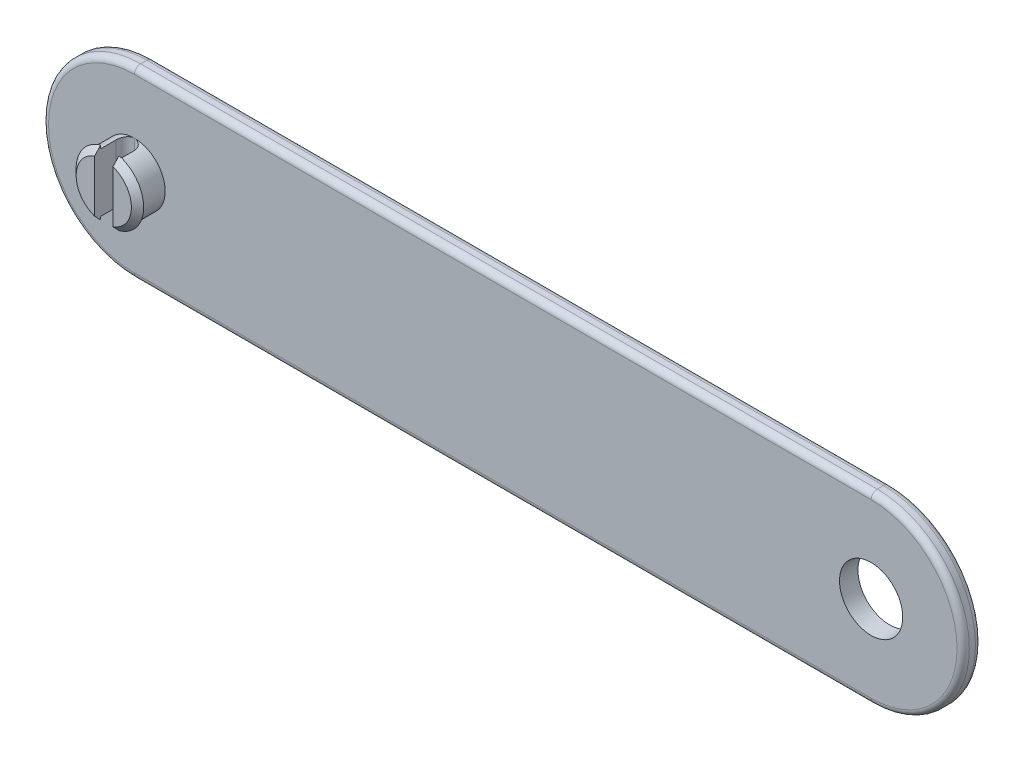
ISO-10303-21;
HEADER;
FILE_DESCRIPTION(('STEP AP214'),'2;1');
FILE_NAME('part.step','',(''),(''),'','','');
FILE_SCHEMA(('AUTOMOTIVE_DESIGN { 1 0 10303 214 1 1 1 1 }'));
ENDSEC;
DATA;
#1=APPLICATION_CONTEXT('core data for automotive mechanical design processes');
#2=APPLICATION_PROTOCOL_DEFINITION('international standard','automotive_design',2000,#1);
#3=PRODUCT_CONTEXT('',#1,'mechanical');
#4=PRODUCT('Part','Part','',(#3));
#5=PRODUCT_RELATED_PRODUCT_CATEGORY('part','',(#4));
#6=PRODUCT_DEFINITION_FORMATION('','',#4);
#7=PRODUCT_DEFINITION_CONTEXT('part definition',#1,'design');
#8=PRODUCT_DEFINITION('design','',#6,#7);
#9=PRODUCT_DEFINITION_SHAPE('','',#8);
#10=(LENGTH_UNIT() NAMED_UNIT(*) SI_UNIT(.MILLI.,.METRE.));
#11=(NAMED_UNIT(*) PLANE_ANGLE_UNIT() SI_UNIT($,.RADIAN.));
#12=(NAMED_UNIT(*) SI_UNIT($,.STERADIAN.) SOLID_ANGLE_UNIT());
#13=UNCERTAINTY_MEASURE_WITH_UNIT(LENGTH_MEASURE(1.E-05),#10,'distance_accuracy_value','');
#14=(GEOMETRIC_REPRESENTATION_CONTEXT(3) GLOBAL_UNCERTAINTY_ASSIGNED_CONTEXT((#13)) GLOBAL_UNIT_ASSIGNED_CONTEXT((#10,
#11,#12)) REPRESENTATION_CONTEXT('',''));
#15=CARTESIAN_POINT('',(0.,0.,0.));
#16=DIRECTION('',(0.,0.,1.));
#17=DIRECTION('',(1.,0.,0.));
#18=AXIS2_PLACEMENT_3D('',#15,#16,#17);
#19=CARTESIAN_POINT('',(0.,0.,3.));
#20=DIRECTION('',(0.,0.,1.));
#21=DIRECTION('',(1.,0.,0.));
#22=AXIS2_PLACEMENT_3D('',#19,#20,#21);
#23=PLANE('',#22);
#24=DIRECTION('',(1.,0.,0.));
#25=VECTOR('',#24,1.);
#26=CARTESIAN_POINT('',(0.,14.,3.));
#27=LINE('',#26,#25);
#28=CARTESIAN_POINT('',(120.,14.,3.));
#29=VERTEX_POINT('',#28);
#30=CARTESIAN_POINT('',(0.,14.,3.));
#31=VERTEX_POINT('',#30);
#32=EDGE_CURVE('E319',#29,#31,#27,.F.);
#33=ORIENTED_EDGE('',*,*,#32,.T.);
#34=CARTESIAN_POINT('',(0.,0.,3.));
#35=DIRECTION('',(0.,0.,1.));
#36=DIRECTION('',(1.,0.,0.));
#37=AXIS2_PLACEMENT_3D('',#34,#35,#36);
#38=CIRCLE('',#37,14.);
#39=CARTESIAN_POINT('',(0.,-14.,3.));
#40=VERTEX_POINT('',#39);
#41=EDGE_CURVE('E324',#31,#40,#38,.T.);
#42=ORIENTED_EDGE('',*,*,#41,.T.);
#43=DIRECTION('',(1.,0.,0.));
#44=VECTOR('',#43,1.);
#45=CARTESIAN_POINT('',(120.,-14.,3.));
#46=LINE('',#45,#44);
#47=CARTESIAN_POINT('',(120.,-14.,3.));
#48=VERTEX_POINT('',#47);
#49=EDGE_CURVE('E65',#40,#48,#46,.T.);
#50=ORIENTED_EDGE('',*,*,#49,.T.);
#51=CARTESIAN_POINT('',(120.,0.,3.));
#52=DIRECTION('',(0.,0.,1.));
#53=DIRECTION('',(1.,0.,0.));
#54=AXIS2_PLACEMENT_3D('',#51,#52,#53);
#55=CIRCLE('',#54,14.);
#56=EDGE_CURVE('E321',#48,#29,#55,.T.);
#57=ORIENTED_EDGE('',*,*,#56,.T.);
#58=EDGE_LOOP('',(#33,#42,#50,#57));
#59=FACE_BOUND('',#58,.T.);
#60=CARTESIAN_POINT('',(120.,0.,3.));
#61=DIRECTION('',(0.,0.,1.));
#62=DIRECTION('',(1.,0.,0.));
#63=AXIS2_PLACEMENT_3D('',#60,#61,#62);
#64=CIRCLE('',#63,5.14999999999998);
#65=CARTESIAN_POINT('',(125.15,0.,3.));
#66=VERTEX_POINT('',#65);
#67=EDGE_CURVE('E400',#66,#66,#64,.F.);
#68=ORIENTED_EDGE('',*,*,#67,.T.);
#69=EDGE_LOOP('',(#68));
#70=FACE_BOUND('',#69,.T.);
#71=CARTESIAN_POINT('',(0.,0.,3.));
#72=DIRECTION('',(0.,0.,1.));
#73=DIRECTION('',(1.,0.,0.));
#74=AXIS2_PLACEMENT_3D('',#71,#72,#73);
#75=CIRCLE('',#74,5.);
#76=CARTESIAN_POINT('',(0.,-5.,3.));
#77=VERTEX_POINT('',#76);
#78=CARTESIAN_POINT('',(0.,5.,3.));
#79=VERTEX_POINT('',#78);
#80=EDGE_CURVE('E382',#77,#79,#75,.T.);
#81=ORIENTED_EDGE('',*,*,#80,.F.);
#82=CARTESIAN_POINT('',(0.,0.,3.));
#83=DIRECTION('',(0.,0.,1.));
#84=DIRECTION('',(1.,0.,0.));
#85=AXIS2_PLACEMENT_3D('',#82,#83,#84);
#86=CIRCLE('',#85,5.);
#87=EDGE_CURVE('E379',#79,#77,#86,.T.);
#88=ORIENTED_EDGE('',*,*,#87,.F.);
#89=EDGE_LOOP('',(#81,#88));
#90=FACE_BOUND('',#89,.T.);
#91=ADVANCED_FACE('F41',(#59,#70,#90),#23,.T.);
#92=CARTESIAN_POINT('',(0.,0.,3.));
#93=DIRECTION('',(0.,0.,-1.));
#94=DIRECTION('',(-1.,0.,0.));
#95=AXIS2_PLACEMENT_3D('',#92,#93,#94);
#96=CYLINDRICAL_SURFACE('',#95,15.);
#97=DIRECTION('',(0.,0.,-1.));
#98=VECTOR('',#97,1.);
#99=CARTESIAN_POINT('',(0.,15.,3.));
#100=LINE('',#99,#98);
#101=CARTESIAN_POINT('',(0.,15.,2.));
#102=VERTEX_POINT('',#101);
#103=CARTESIAN_POINT('',(0.,15.,1.));
#104=VERTEX_POINT('',#103);
#105=EDGE_CURVE('E367',#102,#104,#100,.T.);
#106=ORIENTED_EDGE('',*,*,#105,.T.);
#107=CARTESIAN_POINT('',(0.,0.,1.));
#108=DIRECTION('',(0.,0.,1.));
#109=DIRECTION('',(1.,0.,0.));
#110=AXIS2_PLACEMENT_3D('',#107,#108,#109);
#111=CIRCLE('',#110,15.);
#112=CARTESIAN_POINT('',(0.,-15.,1.));
#113=VERTEX_POINT('',#112);
#114=EDGE_CURVE('E299',#104,#113,#111,.T.);
#115=ORIENTED_EDGE('',*,*,#114,.T.);
#116=DIRECTION('',(0.,0.,-1.));
#117=VECTOR('',#116,1.);
#118=CARTESIAN_POINT('',(0.,-15.,3.));
#119=LINE('',#118,#117);
#120=CARTESIAN_POINT('',(0.,-15.,2.));
#121=VERTEX_POINT('',#120);
#122=EDGE_CURVE('E194',#121,#113,#119,.T.);
#123=ORIENTED_EDGE('',*,*,#122,.F.);
#124=CARTESIAN_POINT('',(0.,0.,2.));
#125=DIRECTION('',(0.,0.,1.));
#126=DIRECTION('',(1.,0.,0.));
#127=AXIS2_PLACEMENT_3D('',#124,#125,#126);
#128=CIRCLE('',#127,15.);
#129=EDGE_CURVE('E291',#121,#102,#128,.F.);
#130=ORIENTED_EDGE('',*,*,#129,.T.);
#131=EDGE_LOOP('',(#106,#115,#123,#130));
#132=FACE_BOUND('',#131,.T.);
#133=ADVANCED_FACE('F419',(#132),#96,.T.);
#134=CARTESIAN_POINT('',(0.,-15.,3.));
#135=DIRECTION('',(0.,1.,0.));
#136=DIRECTION('',(0.,0.,1.));
#137=AXIS2_PLACEMENT_3D('',#134,#135,#136);
#138=PLANE('',#137);
#139=ORIENTED_EDGE('',*,*,#122,.T.);
#140=DIRECTION('',(1.,0.,0.));
#141=VECTOR('',#140,1.);
#142=CARTESIAN_POINT('',(0.,-15.,1.));
#143=LINE('',#142,#141);
#144=CARTESIAN_POINT('',(120.,-15.,1.));
#145=VERTEX_POINT('',#144);
#146=EDGE_CURVE('E313',#113,#145,#143,.T.);
#147=ORIENTED_EDGE('',*,*,#146,.T.);
#148=DIRECTION('',(0.,0.,-1.));
#149=VECTOR('',#148,1.);
#150=CARTESIAN_POINT('',(120.,-15.,3.));
#151=LINE('',#150,#149);
#152=CARTESIAN_POINT('',(120.,-15.,2.));
#153=VERTEX_POINT('',#152);
#154=EDGE_CURVE('E357',#153,#145,#151,.T.);
#155=ORIENTED_EDGE('',*,*,#154,.F.);
#156=DIRECTION('',(1.,0.,0.));
#157=VECTOR('',#156,1.);
#158=CARTESIAN_POINT('',(0.,-15.,2.));
#159=LINE('',#158,#157);
#160=EDGE_CURVE('E311',#153,#121,#159,.F.);
#161=ORIENTED_EDGE('',*,*,#160,.T.);
#162=EDGE_LOOP('',(#139,#147,#155,#161));
#163=FACE_BOUND('',#162,.T.);
#164=ADVANCED_FACE('F363',(#163),#138,.F.);
#165=CARTESIAN_POINT('',(120.,0.,3.));
#166=DIRECTION('',(0.,0.,-1.));
#167=DIRECTION('',(-1.,0.,0.));
#168=AXIS2_PLACEMENT_3D('',#165,#166,#167);
#169=CYLINDRICAL_SURFACE('',#168,15.);
#170=ORIENTED_EDGE('',*,*,#154,.T.);
#171=CARTESIAN_POINT('',(120.,0.,1.));
#172=DIRECTION('',(0.,0.,1.));
#173=DIRECTION('',(1.,0.,0.));
#174=AXIS2_PLACEMENT_3D('',#171,#172,#173);
#175=CIRCLE('',#174,15.);
#176=CARTESIAN_POINT('',(120.,15.,1.));
#177=VERTEX_POINT('',#176);
#178=EDGE_CURVE('E317',#145,#177,#175,.T.);
#179=ORIENTED_EDGE('',*,*,#178,.T.);
#180=DIRECTION('',(0.,0.,-1.));
#181=VECTOR('',#180,1.);
#182=CARTESIAN_POINT('',(120.,15.,3.));
#183=LINE('',#182,#181);
#184=CARTESIAN_POINT('',(120.,15.,2.));
#185=VERTEX_POINT('',#184);
#186=EDGE_CURVE('E360',#185,#177,#183,.T.);
#187=ORIENTED_EDGE('',*,*,#186,.F.);
#188=CARTESIAN_POINT('',(120.,0.,2.));
#189=DIRECTION('',(0.,0.,1.));
#190=DIRECTION('',(1.,0.,0.));
#191=AXIS2_PLACEMENT_3D('',#188,#189,#190);
#192=CIRCLE('',#191,15.);
#193=EDGE_CURVE('E315',#185,#153,#192,.F.);
#194=ORIENTED_EDGE('',*,*,#193,.T.);
#195=EDGE_LOOP('',(#170,#179,#187,#194));
#196=FACE_BOUND('',#195,.T.);
#197=ADVANCED_FACE('F356',(#196),#169,.T.);
#198=CARTESIAN_POINT('',(0.,15.,3.));
#199=DIRECTION('',(0.,1.,0.));
#200=DIRECTION('',(0.,0.,1.));
#201=AXIS2_PLACEMENT_3D('',#198,#199,#200);
#202=PLANE('',#201);
#203=ORIENTED_EDGE('',*,*,#186,.T.);
#204=DIRECTION('',(1.,0.,0.));
#205=VECTOR('',#204,1.);
#206=CARTESIAN_POINT('',(0.,15.,1.));
#207=LINE('',#206,#205);
#208=EDGE_CURVE('E11',#177,#104,#207,.F.);
#209=ORIENTED_EDGE('',*,*,#208,.T.);
#210=ORIENTED_EDGE('',*,*,#105,.F.);
#211=DIRECTION('',(1.,0.,0.));
#212=VECTOR('',#211,1.);
#213=CARTESIAN_POINT('',(0.,15.,2.));
#214=LINE('',#213,#212);
#215=EDGE_CURVE('E50',#102,#185,#214,.T.);
#216=ORIENTED_EDGE('',*,*,#215,.T.);
#217=EDGE_LOOP('',(#203,#209,#210,#216));
#218=FACE_BOUND('',#217,.T.);
#219=ADVANCED_FACE('F428',(#218),#202,.T.);
#220=CARTESIAN_POINT('',(0.,0.,0.));
#221=DIRECTION('',(0.,0.,1.));
#222=DIRECTION('',(1.,0.,0.));
#223=AXIS2_PLACEMENT_3D('',#220,#221,#222);
#224=PLANE('',#223);
#225=DIRECTION('',(1.,0.,0.));
#226=VECTOR('',#225,1.);
#227=CARTESIAN_POINT('',(0.,-14.,0.));
#228=LINE('',#227,#226);
#229=CARTESIAN_POINT('',(120.,-14.,0.));
#230=VERTEX_POINT('',#229);
#231=CARTESIAN_POINT('',(0.,-14.,0.));
#232=VERTEX_POINT('',#231);
#233=EDGE_CURVE('E306',#230,#232,#228,.F.);
#234=ORIENTED_EDGE('',*,*,#233,.T.);
#235=CARTESIAN_POINT('',(0.,0.,0.));
#236=DIRECTION('',(0.,0.,1.));
#237=DIRECTION('',(1.,0.,0.));
#238=AXIS2_PLACEMENT_3D('',#235,#236,#237);
#239=CIRCLE('',#238,14.);
#240=CARTESIAN_POINT('',(0.,14.,0.));
#241=VERTEX_POINT('',#240);
#242=EDGE_CURVE('E308',#232,#241,#239,.F.);
#243=ORIENTED_EDGE('',*,*,#242,.T.);
#244=DIRECTION('',(1.,0.,0.));
#245=VECTOR('',#244,1.);
#246=CARTESIAN_POINT('',(120.,14.,0.));
#247=LINE('',#246,#245);
#248=CARTESIAN_POINT('',(120.,14.,0.));
#249=VERTEX_POINT('',#248);
#250=EDGE_CURVE('E302',#241,#249,#247,.T.);
#251=ORIENTED_EDGE('',*,*,#250,.T.);
#252=CARTESIAN_POINT('',(120.,0.,0.));
#253=DIRECTION('',(0.,0.,1.));
#254=DIRECTION('',(1.,0.,0.));
#255=AXIS2_PLACEMENT_3D('',#252,#253,#254);
#256=CIRCLE('',#255,14.);
#257=EDGE_CURVE('E304',#249,#230,#256,.F.);
#258=ORIENTED_EDGE('',*,*,#257,.T.);
#259=EDGE_LOOP('',(#234,#243,#251,#258));
#260=FACE_BOUND('',#259,.T.);
#261=CARTESIAN_POINT('',(120.,0.,0.));
#262=DIRECTION('',(0.,0.,1.));
#263=DIRECTION('',(1.,0.,0.));
#264=AXIS2_PLACEMENT_3D('',#261,#262,#263);
#265=CIRCLE('',#264,5.14999999999998);
#266=CARTESIAN_POINT('',(125.15,0.,0.));
#267=VERTEX_POINT('',#266);
#268=EDGE_CURVE('E295',#267,#267,#265,.T.);
#269=ORIENTED_EDGE('',*,*,#268,.T.);
#270=EDGE_LOOP('',(#269));
#271=FACE_BOUND('',#270,.T.);
#272=ADVANCED_FACE('F407',(#260,#271),#224,.F.);
#273=CARTESIAN_POINT('',(0.,0.,7.));
#274=DIRECTION('',(0.,0.,-1.));
#275=DIRECTION('',(-1.,0.,0.));
#276=AXIS2_PLACEMENT_3D('',#273,#274,#275);
#277=CYLINDRICAL_SURFACE('',#276,5.);
#278=ORIENTED_EDGE('',*,*,#87,.T.);
#279=CARTESIAN_POINT('',(0.,-5.,3.));
#280=CARTESIAN_POINT('',(-0.0412230773899798,-5.00000277613312,2.99999925912565));
#281=CARTESIAN_POINT('',(-0.082425557098246,-4.99948958398081,3.00170043926399));
#282=CARTESIAN_POINT('',(-0.164518730866947,-4.99746087704898,3.00848041599295));
#283=CARTESIAN_POINT('',(-0.205409485177793,-4.9959455611979,3.01355854223773));
#284=CARTESIAN_POINT('',(-0.326963301776201,-4.98995381331756,3.03377517530363));
#285=CARTESIAN_POINT('',(-0.406785158642713,-4.98403118606551,3.05389634922364));
#286=CARTESIAN_POINT('',(-0.561734538434264,-4.96895678681408,3.10674287914124));
#287=CARTESIAN_POINT('',(-0.636863069535107,-4.95980571114645,3.13946551731626));
#288=CARTESIAN_POINT('',(-0.780600785691843,-4.9392243551907,3.21652309467646));
#289=CARTESIAN_POINT('',(-0.849207204843492,-4.92779311423826,3.2608629308205));
#290=CARTESIAN_POINT('',(-0.97986969539363,-4.90350796272656,3.36122156640607));
#291=CARTESIAN_POINT('',(-1.0417124952522,-4.8906250718143,3.41751086871889));
#292=CARTESIAN_POINT('',(-1.15524422121796,-4.86505948668359,3.53960362636054));
#293=CARTESIAN_POINT('',(-1.20693049442307,-4.85237684556416,3.6054095596784));
#294=CARTESIAN_POINT('',(-1.29981663905891,-4.82833698781928,3.74649383123076));
#295=CARTESIAN_POINT('',(-1.34075062074078,-4.81701657361783,3.82195389706853));
#296=CARTESIAN_POINT('',(-1.40923482373452,-4.79742985037451,3.97905482734796));
#297=CARTESIAN_POINT('',(-1.43679764279335,-4.78916066835566,4.06068978989199));
#298=CARTESIAN_POINT('',(-1.47137173672671,-4.77862845517374,4.20226791879962));
#299=CARTESIAN_POINT('',(-1.48208442594249,-4.77530350348451,4.26125369965697));
#300=CARTESIAN_POINT('',(-1.49640626854262,-4.7708262463819,4.38014739106727));
#301=CARTESIAN_POINT('',(-1.5000169977961,-4.76967345898471,4.44005509407892));
#302=CARTESIAN_POINT('',(-1.5,-4.76969600708473,4.5));
#303=B_SPLINE_CURVE_WITH_KNOTS('',3,(#279,#280,#281,#282,#283,#284,#285,#286,#287,#288,#289,
#290,#291,#292,#293,#294,#295,#296,#297,#298,#299,#300,#301,#302),.UNSPECIFIED.,.F.,.F.,(4,2,2,
2,2,2,2,2,2,2,2,4),(0.,0.123590522760266,0.247156519315276,0.493467728235495,0.739725843675752,
0.986087930955972,1.23877207809718,1.49152213929098,1.75003354782293,2.00830092246139,
2.18798745648376,2.36763411497588),.UNSPECIFIED.);
#304=CARTESIAN_POINT('',(-1.5,-4.76969600708473,4.5));
#305=VERTEX_POINT('',#304);
#306=EDGE_CURVE('E272',#77,#305,#303,.T.);
#307=ORIENTED_EDGE('',*,*,#306,.T.);
#308=DIRECTION('',(0.,0.,-1.));
#309=VECTOR('',#308,1.);
#310=CARTESIAN_POINT('',(-1.5,-4.76969600708473,7.));
#311=LINE('',#310,#309);
#312=CARTESIAN_POINT('',(-1.5,-4.76969600708473,7.));
#313=VERTEX_POINT('',#312);
#314=EDGE_CURVE('E372',#313,#305,#311,.T.);
#315=ORIENTED_EDGE('',*,*,#314,.F.);
#316=CARTESIAN_POINT('',(0.,0.,7.));
#317=DIRECTION('',(0.,0.,1.));
#318=DIRECTION('',(1.,0.,0.));
#319=AXIS2_PLACEMENT_3D('',#316,#317,#318);
#320=CIRCLE('',#319,5.);
#321=CARTESIAN_POINT('',(-1.5,4.76969600708473,7.));
#322=VERTEX_POINT('',#321);
#323=EDGE_CURVE('E378',#322,#313,#320,.T.);
#324=ORIENTED_EDGE('',*,*,#323,.F.);
#325=DIRECTION('',(0.,0.,-1.));
#326=VECTOR('',#325,1.);
#327=CARTESIAN_POINT('',(-1.5,4.76969600708473,7.));
#328=LINE('',#327,#326);
#329=CARTESIAN_POINT('',(-1.5,4.76969600708473,4.5));
#330=VERTEX_POINT('',#329);
#331=EDGE_CURVE('E375',#322,#330,#328,.T.);
#332=ORIENTED_EDGE('',*,*,#331,.T.);
#333=CARTESIAN_POINT('',(-1.5,4.76969600708473,4.5));
#334=CARTESIAN_POINT('',(-1.50000085359986,4.76969248993095,4.45881918932386));
#335=CARTESIAN_POINT('',(-1.49830305374631,4.77023000663726,4.41765912115535));
#336=CARTESIAN_POINT('',(-1.49153727481279,4.77235113343356,4.33565320311231));
#337=CARTESIAN_POINT('',(-1.48647005385463,4.77393450820429,4.29480728464472));
#338=CARTESIAN_POINT('',(-1.46630065235378,4.78018533002168,4.17340395624687));
#339=CARTESIAN_POINT('',(-1.44623028637151,4.78635397305578,4.09369093965724));
#340=CARTESIAN_POINT('',(-1.39353147335906,4.80195939037487,3.93896571877284));
#341=CARTESIAN_POINT('',(-1.36090719903445,4.81139507864529,3.86395196214715));
#342=CARTESIAN_POINT('',(-1.28407985018232,4.8324653260204,3.7204056008968));
#343=CARTESIAN_POINT('',(-1.23987100279312,4.8441009806121,3.65187625084195));
#344=CARTESIAN_POINT('',(-1.13964930893702,4.86866818200433,3.5211348309649));
#345=CARTESIAN_POINT('',(-1.08333633607985,4.88162718483485,3.45915804950034));
#346=CARTESIAN_POINT('',(-0.961140113903202,4.90714781796852,3.34536568202602));
#347=CARTESIAN_POINT('',(-0.895255002005047,4.9197093703538,3.2935520782231));
#348=CARTESIAN_POINT('',(-0.754090160225413,4.94333592434221,3.2005222228324));
#349=CARTESIAN_POINT('',(-0.678642338077988,4.95436400128813,3.15955109688797));
#350=CARTESIAN_POINT('',(-0.521563369050342,4.97335005202751,3.0909932692418));
#351=CARTESIAN_POINT('',(-0.43993764984166,4.98131068415015,3.06339497292421));
#352=CARTESIAN_POINT('',(-0.298264456021694,4.99143710038863,3.02873103887292));
#353=CARTESIAN_POINT('',(-0.239166490668785,4.99462764738926,3.01797863412638));
#354=CARTESIAN_POINT('',(-0.120057391419018,4.99891817852599,3.00360598264217));
#355=CARTESIAN_POINT('',(-0.0600465820525033,5.00001888889584,2.99998325827159));
#356=CARTESIAN_POINT('',(0.,5.,3.));
#357=B_SPLINE_CURVE_WITH_KNOTS('',3,(#333,#334,#335,#336,#337,#338,#339,#340,#341,#342,#343,
#344,#345,#346,#347,#348,#349,#350,#351,#352,#353,#354,#355,#356),.UNSPECIFIED.,.F.,.F.,(4,2,2,
2,2,2,2,2,2,2,2,4),(0.,0.123463321048067,0.246898872168488,0.492911372366582,0.738842172727396,
0.984895759946681,1.23795183323011,1.49105721311967,1.74947248420819,2.00766329935825,
2.1876802778492,2.36763468764484),.UNSPECIFIED.);
#358=EDGE_CURVE('E266',#330,#79,#357,.T.);
#359=ORIENTED_EDGE('',*,*,#358,.T.);
#360=EDGE_LOOP('',(#278,#307,#315,#324,#332,#359));
#361=FACE_BOUND('',#360,.T.);
#362=ADVANCED_FACE('F225',(#361),#277,.T.);
#363=CARTESIAN_POINT('',(-1.5,4.76969600708473,7.));
#364=DIRECTION('',(-1.,0.,0.));
#365=DIRECTION('',(0.,0.,1.));
#366=AXIS2_PLACEMENT_3D('',#363,#364,#365);
#367=PLANE('',#366);
#368=ORIENTED_EDGE('',*,*,#314,.T.);
#369=DIRECTION('',(0.,1.,0.));
#370=VECTOR('',#369,1.);
#371=CARTESIAN_POINT('',(-1.5,4.76969600708473,4.5));
#372=LINE('',#371,#370);
#373=EDGE_CURVE('E243',#305,#330,#372,.T.);
#374=ORIENTED_EDGE('',*,*,#373,.T.);
#375=ORIENTED_EDGE('',*,*,#331,.F.);
#376=DIRECTION('',(0.,1.,0.));
#377=VECTOR('',#376,1.);
#378=CARTESIAN_POINT('',(-1.5,5.29150262212918,7.));
#379=LINE('',#378,#377);
#380=CARTESIAN_POINT('',(-1.5,5.29150262212918,7.));
#381=VERTEX_POINT('',#380);
#382=EDGE_CURVE('E395',#322,#381,#379,.T.);
#383=ORIENTED_EDGE('',*,*,#382,.T.);
#384=CARTESIAN_POINT('',(-1.5,5.29150262212918,6.99999999999997));
#385=CARTESIAN_POINT('',(-1.5,5.20447414806338,7.08372769626347));
#386=CARTESIAN_POINT('',(-1.5,5.11737049196801,7.16737736019556));
#387=CARTESIAN_POINT('',(-1.5,4.94298604304669,7.3344907292714));
#388=CARTESIAN_POINT('',(-1.5,4.85570525133473,7.41795443557774));
#389=CARTESIAN_POINT('',(-1.5,4.68093851584005,7.58466719096903));
#390=CARTESIAN_POINT('',(-1.5,4.59345257170054,7.66791623968013));
#391=CARTESIAN_POINT('',(-1.5,4.41823789495103,7.83415950995));
#392=CARTESIAN_POINT('',(-1.5,4.33050916081907,7.91715372990442));
#393=CARTESIAN_POINT('',(-1.5,4.24264068711926,8.));
#394=B_SPLINE_CURVE_WITH_KNOTS('',3,(#384,#385,#386,#387,#388,#389,#390,#391,#392,#393),
.UNSPECIFIED.,.F.,.F.,(4,2,2,2,4),(0.,0.362296270250939,0.724590269047752,1.08688489839685,
1.44918180400598),.UNSPECIFIED.);
#395=CARTESIAN_POINT('',(-1.5,4.24264068711926,8.));
#396=VERTEX_POINT('',#395);
#397=EDGE_CURVE('E231',#381,#396,#394,.T.);
#398=ORIENTED_EDGE('',*,*,#397,.T.);
#399=DIRECTION('',(0.,1.,0.));
#400=VECTOR('',#399,1.);
#401=CARTESIAN_POINT('',(-1.5,5.29150262212918,8.));
#402=LINE('',#401,#400);
#403=CARTESIAN_POINT('',(-1.5,-4.24264068711926,8.));
#404=VERTEX_POINT('',#403);
#405=EDGE_CURVE('E391',#404,#396,#402,.T.);
#406=ORIENTED_EDGE('',*,*,#405,.F.);
#407=CARTESIAN_POINT('',(-1.5,-4.24264068711926,8.));
#408=CARTESIAN_POINT('',(-1.5,-4.33050916081907,7.91715372990442));
#409=CARTESIAN_POINT('',(-1.5,-4.41823789495103,7.83415950995));
#410=CARTESIAN_POINT('',(-1.5,-4.59345257170054,7.66791623968013));
#411=CARTESIAN_POINT('',(-1.5,-4.68093851584005,7.58466719096903));
#412=CARTESIAN_POINT('',(-1.5,-4.85570525133473,7.41795443557774));
#413=CARTESIAN_POINT('',(-1.5,-4.94298604304669,7.3344907292714));
#414=CARTESIAN_POINT('',(-1.5,-5.11737049196801,7.16737736019556));
#415=CARTESIAN_POINT('',(-1.5,-5.20447414806338,7.08372769626347));
#416=CARTESIAN_POINT('',(-1.5,-5.29150262212918,6.99999999999997));
#417=B_SPLINE_CURVE_WITH_KNOTS('',3,(#407,#408,#409,#410,#411,#412,#413,#414,#415,#416),
.UNSPECIFIED.,.F.,.F.,(4,2,2,2,4),(0.,0.362296905609131,0.724591534958228,1.08688553375504,
1.44918180400598),.UNSPECIFIED.);
#418=CARTESIAN_POINT('',(-1.5,-5.29150262212918,7.));
#419=VERTEX_POINT('',#418);
#420=EDGE_CURVE('E237',#404,#419,#417,.T.);
#421=ORIENTED_EDGE('',*,*,#420,.T.);
#422=EDGE_CURVE('E392',#419,#313,#379,.T.);
#423=ORIENTED_EDGE('',*,*,#422,.T.);
#424=EDGE_LOOP('',(#368,#374,#375,#383,#398,#406,#421,#423));
#425=FACE_BOUND('',#424,.T.);
#426=ADVANCED_FACE('F220',(#425),#367,.F.);
#427=CARTESIAN_POINT('',(0.,0.,7.));
#428=DIRECTION('',(0.,0.,-1.));
#429=DIRECTION('',(-1.,0.,0.));
#430=AXIS2_PLACEMENT_3D('',#427,#428,#429);
#431=CYLINDRICAL_SURFACE('',#430,5.);
#432=ORIENTED_EDGE('',*,*,#80,.T.);
#433=CARTESIAN_POINT('',(0.,5.,3.));
#434=CARTESIAN_POINT('',(0.0412230773899829,5.00000277613312,2.99999925912565));
#435=CARTESIAN_POINT('',(0.0824255570982492,4.99948958398081,3.00170043926399));
#436=CARTESIAN_POINT('',(0.164518730866951,4.99746087704899,3.00848041599295));
#437=CARTESIAN_POINT('',(0.205409485177797,4.9959455611979,3.01355854223773));
#438=CARTESIAN_POINT('',(0.326963301776204,4.98995381331756,3.03377517530363));
#439=CARTESIAN_POINT('',(0.406785158642716,4.98403118606551,3.05389634922364));
#440=CARTESIAN_POINT('',(0.561734538434267,4.96895678681408,3.10674287914124));
#441=CARTESIAN_POINT('',(0.63686306953511,4.95980571114645,3.13946551731626));
#442=CARTESIAN_POINT('',(0.780600785691846,4.9392243551907,3.21652309467646));
#443=CARTESIAN_POINT('',(0.849207204843496,4.92779311423826,3.2608629308205));
#444=CARTESIAN_POINT('',(0.979869695393634,4.90350796272656,3.36122156640607));
#445=CARTESIAN_POINT('',(1.04171249525221,4.8906250718143,3.41751086871889));
#446=CARTESIAN_POINT('',(1.15524422121796,4.86505948668359,3.53960362636055));
#447=CARTESIAN_POINT('',(1.20693049442308,4.85237684556416,3.6054095596784));
#448=CARTESIAN_POINT('',(1.29981663905892,4.82833698781928,3.74649383123077));
#449=CARTESIAN_POINT('',(1.34075062074078,4.81701657361783,3.82195389706853));
#450=CARTESIAN_POINT('',(1.40923482373453,4.79742985037451,3.97905482734796));
#451=CARTESIAN_POINT('',(1.43679764279335,4.78916066835566,4.06068978989199));
#452=CARTESIAN_POINT('',(1.47137173672671,4.77862845517374,4.20226791879962));
#453=CARTESIAN_POINT('',(1.48208442594249,4.77530350348451,4.26125369965697));
#454=CARTESIAN_POINT('',(1.49640626854262,4.7708262463819,4.38014739106727));
#455=CARTESIAN_POINT('',(1.5000169977961,4.7696734589847,4.44005509407892));
#456=CARTESIAN_POINT('',(1.5,4.76969600708473,4.5));
#457=B_SPLINE_CURVE_WITH_KNOTS('',3,(#433,#434,#435,#436,#437,#438,#439,#440,#441,#442,#443,
#444,#445,#446,#447,#448,#449,#450,#451,#452,#453,#454,#455,#456),.UNSPECIFIED.,.F.,.F.,(4,2,2,
2,2,2,2,2,2,2,2,4),(0.,0.123590522760266,0.247156519315276,0.493467728235495,0.739725843675752,
0.986087930955972,1.23877207809718,1.49152213929098,1.75003354782293,2.00830092246139,
2.18798745648376,2.36763411497588),.UNSPECIFIED.);
#458=CARTESIAN_POINT('',(1.5,4.76969600708473,4.5));
#459=VERTEX_POINT('',#458);
#460=EDGE_CURVE('E285',#79,#459,#457,.T.);
#461=ORIENTED_EDGE('',*,*,#460,.T.);
#462=DIRECTION('',(0.,0.,-1.));
#463=VECTOR('',#462,1.);
#464=CARTESIAN_POINT('',(1.5,4.76969600708473,7.));
#465=LINE('',#464,#463);
#466=CARTESIAN_POINT('',(1.5,4.76969600708473,7.));
#467=VERTEX_POINT('',#466);
#468=EDGE_CURVE('E389',#467,#459,#465,.T.);
#469=ORIENTED_EDGE('',*,*,#468,.F.);
#470=CARTESIAN_POINT('',(0.,0.,7.));
#471=DIRECTION('',(0.,0.,1.));
#472=DIRECTION('',(1.,0.,0.));
#473=AXIS2_PLACEMENT_3D('',#470,#471,#472);
#474=CIRCLE('',#473,5.);
#475=CARTESIAN_POINT('',(1.5,-4.76969600708473,7.));
#476=VERTEX_POINT('',#475);
#477=EDGE_CURVE('E385',#476,#467,#474,.T.);
#478=ORIENTED_EDGE('',*,*,#477,.F.);
#479=DIRECTION('',(0.,0.,-1.));
#480=VECTOR('',#479,1.);
#481=CARTESIAN_POINT('',(1.5,-4.76969600708473,7.));
#482=LINE('',#481,#480);
#483=CARTESIAN_POINT('',(1.5,-4.76969600708473,4.5));
#484=VERTEX_POINT('',#483);
#485=EDGE_CURVE('E171',#476,#484,#482,.T.);
#486=ORIENTED_EDGE('',*,*,#485,.T.);
#487=CARTESIAN_POINT('',(1.5,-4.76969600708473,4.5));
#488=CARTESIAN_POINT('',(1.50000085359987,-4.76969248993095,4.45881918932386));
#489=CARTESIAN_POINT('',(1.49830305374632,-4.77023000663726,4.41765912115535));
#490=CARTESIAN_POINT('',(1.49153727481279,-4.77235113343356,4.33565320311231));
#491=CARTESIAN_POINT('',(1.48647005385463,-4.77393450820429,4.29480728464472));
#492=CARTESIAN_POINT('',(1.46630065235378,-4.78018533002168,4.17340395624687));
#493=CARTESIAN_POINT('',(1.44623028637152,-4.78635397305578,4.09369093965724));
#494=CARTESIAN_POINT('',(1.39353147335906,-4.80195939037487,3.93896571877284));
#495=CARTESIAN_POINT('',(1.36090719903445,-4.81139507864529,3.86395196214715));
#496=CARTESIAN_POINT('',(1.28407985018232,-4.8324653260204,3.7204056008968));
#497=CARTESIAN_POINT('',(1.23987100279312,-4.8441009806121,3.65187625084195));
#498=CARTESIAN_POINT('',(1.13964930893702,-4.86866818200433,3.5211348309649));
#499=CARTESIAN_POINT('',(1.08333633607985,-4.88162718483485,3.45915804950034));
#500=CARTESIAN_POINT('',(0.961140113903205,-4.90714781796852,3.34536568202602));
#501=CARTESIAN_POINT('',(0.895255002005051,-4.9197093703538,3.2935520782231));
#502=CARTESIAN_POINT('',(0.754090160225417,-4.94333592434221,3.2005222228324));
#503=CARTESIAN_POINT('',(0.678642338077992,-4.95436400128813,3.15955109688797));
#504=CARTESIAN_POINT('',(0.521563369050345,-4.97335005202751,3.0909932692418));
#505=CARTESIAN_POINT('',(0.439937649841664,-4.98131068415015,3.06339497292421));
#506=CARTESIAN_POINT('',(0.298264456021697,-4.99143710038863,3.02873103887292));
#507=CARTESIAN_POINT('',(0.239166490668788,-4.99462764738926,3.01797863412638));
#508=CARTESIAN_POINT('',(0.120057391419021,-4.99891817852599,3.00360598264217));
#509=CARTESIAN_POINT('',(0.0600465820525062,-5.00001888889584,2.99998325827159));
#510=CARTESIAN_POINT('',(0.,-5.,3.));
#511=B_SPLINE_CURVE_WITH_KNOTS('',3,(#487,#488,#489,#490,#491,#492,#493,#494,#495,#496,#497,
#498,#499,#500,#501,#502,#503,#504,#505,#506,#507,#508,#509,#510),.UNSPECIFIED.,.F.,.F.,(4,2,2,
2,2,2,2,2,2,2,2,4),(0.,0.123463321048067,0.246898872168488,0.492911372366582,0.738842172727396,
0.984895759946681,1.23795183323011,1.49105721311967,1.74947248420819,2.00766329935825,
2.1876802778492,2.36763468764484),.UNSPECIFIED.);
#512=EDGE_CURVE('E278',#484,#77,#511,.T.);
#513=ORIENTED_EDGE('',*,*,#512,.T.);
#514=EDGE_LOOP('',(#432,#461,#469,#478,#486,#513));
#515=FACE_BOUND('',#514,.T.);
#516=ADVANCED_FACE('F217',(#515),#431,.T.);
#517=CARTESIAN_POINT('',(1.5,4.76969600708473,7.));
#518=DIRECTION('',(1.,0.,0.));
#519=DIRECTION('',(0.,0.,-1.));
#520=AXIS2_PLACEMENT_3D('',#517,#518,#519);
#521=PLANE('',#520);
#522=ORIENTED_EDGE('',*,*,#468,.T.);
#523=DIRECTION('',(0.,-1.,0.));
#524=VECTOR('',#523,1.);
#525=CARTESIAN_POINT('',(1.5,4.76969600708473,4.5));
#526=LINE('',#525,#524);
#527=EDGE_CURVE('E704',#459,#484,#526,.T.);
#528=ORIENTED_EDGE('',*,*,#527,.T.);
#529=ORIENTED_EDGE('',*,*,#485,.F.);
#530=DIRECTION('',(0.,-1.,0.));
#531=VECTOR('',#530,1.);
#532=CARTESIAN_POINT('',(1.5,5.29150262212918,7.));
#533=LINE('',#532,#531);
#534=CARTESIAN_POINT('',(1.5,-5.29150262212918,7.));
#535=VERTEX_POINT('',#534);
#536=EDGE_CURVE('E162',#476,#535,#533,.T.);
#537=ORIENTED_EDGE('',*,*,#536,.T.);
#538=CARTESIAN_POINT('',(1.5,-5.29150262212918,6.99999999999997));
#539=CARTESIAN_POINT('',(1.5,-5.20447414806338,7.08372769626347));
#540=CARTESIAN_POINT('',(1.5,-5.11737049196801,7.16737736019556));
#541=CARTESIAN_POINT('',(1.5,-4.94298604304669,7.3344907292714));
#542=CARTESIAN_POINT('',(1.5,-4.85570525133473,7.41795443557774));
#543=CARTESIAN_POINT('',(1.5,-4.68093851584005,7.58466719096903));
#544=CARTESIAN_POINT('',(1.5,-4.59345257170054,7.66791623968013));
#545=CARTESIAN_POINT('',(1.5,-4.41823789495103,7.83415950995));
#546=CARTESIAN_POINT('',(1.5,-4.33050916081907,7.91715372990442));
#547=CARTESIAN_POINT('',(1.5,-4.24264068711926,8.));
#548=B_SPLINE_CURVE_WITH_KNOTS('',3,(#538,#539,#540,#541,#542,#543,#544,#545,#546,#547),
.UNSPECIFIED.,.F.,.F.,(4,2,2,2,4),(0.,0.362296270250941,0.724590269047752,1.08688489839685,
1.44918180400598),.UNSPECIFIED.);
#549=CARTESIAN_POINT('',(1.5,-4.24264068711926,8.));
#550=VERTEX_POINT('',#549);
#551=EDGE_CURVE('E168',#535,#550,#548,.T.);
#552=ORIENTED_EDGE('',*,*,#551,.T.);
#553=DIRECTION('',(0.,-1.,0.));
#554=VECTOR('',#553,1.);
#555=CARTESIAN_POINT('',(1.5,5.29150262212918,8.));
#556=LINE('',#555,#554);
#557=CARTESIAN_POINT('',(1.5,4.24264068711926,8.));
#558=VERTEX_POINT('',#557);
#559=EDGE_CURVE('E176',#558,#550,#556,.T.);
#560=ORIENTED_EDGE('',*,*,#559,.F.);
#561=CARTESIAN_POINT('',(1.5,4.24264068711926,8.));
#562=CARTESIAN_POINT('',(1.5,4.33050916081907,7.91715372990442));
#563=CARTESIAN_POINT('',(1.5,4.41823789495103,7.83415950994999));
#564=CARTESIAN_POINT('',(1.5,4.59345257170054,7.66791623968013));
#565=CARTESIAN_POINT('',(1.5,4.68093851584005,7.58466719096903));
#566=CARTESIAN_POINT('',(1.5,4.85570525133473,7.41795443557774));
#567=CARTESIAN_POINT('',(1.5,4.94298604304669,7.3344907292714));
#568=CARTESIAN_POINT('',(1.5,5.11737049196801,7.16737736019556));
#569=CARTESIAN_POINT('',(1.5,5.20447414806338,7.08372769626347));
#570=CARTESIAN_POINT('',(1.5,5.29150262212918,6.99999999999997));
#571=B_SPLINE_CURVE_WITH_KNOTS('',3,(#561,#562,#563,#564,#565,#566,#567,#568,#569,#570),
.UNSPECIFIED.,.F.,.F.,(4,2,2,2,4),(0.,0.362296905609132,0.724591534958228,1.08688553375504,
1.44918180400598),.UNSPECIFIED.);
#572=CARTESIAN_POINT('',(1.5,5.29150262212918,7.));
#573=VERTEX_POINT('',#572);
#574=EDGE_CURVE('E190',#558,#573,#571,.T.);
#575=ORIENTED_EDGE('',*,*,#574,.T.);
#576=EDGE_CURVE('E175',#573,#467,#533,.T.);
#577=ORIENTED_EDGE('',*,*,#576,.T.);
#578=EDGE_LOOP('',(#522,#528,#529,#537,#552,#560,#575,#577));
#579=FACE_BOUND('',#578,.T.);
#580=ADVANCED_FACE('F165',(#579),#521,.F.);
#581=CARTESIAN_POINT('',(0.,0.,8.));
#582=DIRECTION('',(0.,0.,1.));
#583=DIRECTION('',(1.,0.,0.));
#584=AXIS2_PLACEMENT_3D('',#581,#582,#583);
#585=PLANE('',#584);
#586=ORIENTED_EDGE('',*,*,#405,.T.);
#587=CARTESIAN_POINT('',(0.,0.,8.));
#588=DIRECTION('',(0.,0.,1.));
#589=DIRECTION('',(1.,0.,0.));
#590=AXIS2_PLACEMENT_3D('',#587,#588,#589);
#591=CIRCLE('',#590,4.49999999999998);
#592=EDGE_CURVE('E192',#396,#404,#591,.T.);
#593=ORIENTED_EDGE('',*,*,#592,.T.);
#594=EDGE_LOOP('',(#586,#593));
#595=FACE_BOUND('',#594,.T.);
#596=ADVANCED_FACE('F216',(#595),#585,.T.);
#597=CARTESIAN_POINT('',(0.,0.,7.));
#598=DIRECTION('',(0.,0.,1.));
#599=DIRECTION('',(1.,0.,0.));
#600=AXIS2_PLACEMENT_3D('',#597,#598,#599);
#601=PLANE('',#600);
#602=ORIENTED_EDGE('',*,*,#382,.F.);
#603=ORIENTED_EDGE('',*,*,#323,.T.);
#604=ORIENTED_EDGE('',*,*,#422,.F.);
#605=CARTESIAN_POINT('',(0.,0.,7.));
#606=DIRECTION('',(0.,0.,1.));
#607=DIRECTION('',(1.,0.,0.));
#608=AXIS2_PLACEMENT_3D('',#605,#606,#607);
#609=CIRCLE('',#608,5.5);
#610=EDGE_CURVE('E184',#381,#419,#609,.T.);
#611=ORIENTED_EDGE('',*,*,#610,.F.);
#612=EDGE_LOOP('',(#602,#603,#604,#611));
#613=FACE_BOUND('',#612,.T.);
#614=ADVANCED_FACE('F480',(#613),#601,.F.);
#615=CARTESIAN_POINT('',(0.,0.,8.));
#616=DIRECTION('',(0.,0.,1.));
#617=DIRECTION('',(1.,0.,0.));
#618=AXIS2_PLACEMENT_3D('',#615,#616,#617);
#619=PLANE('',#618);
#620=ORIENTED_EDGE('',*,*,#559,.T.);
#621=CARTESIAN_POINT('',(0.,0.,8.));
#622=DIRECTION('',(0.,0.,1.));
#623=DIRECTION('',(1.,0.,0.));
#624=AXIS2_PLACEMENT_3D('',#621,#622,#623);
#625=CIRCLE('',#624,4.49999999999998);
#626=EDGE_CURVE('E189',#550,#558,#625,.T.);
#627=ORIENTED_EDGE('',*,*,#626,.T.);
#628=EDGE_LOOP('',(#620,#627));
#629=FACE_BOUND('',#628,.T.);
#630=ADVANCED_FACE('F488',(#629),#619,.T.);
#631=CARTESIAN_POINT('',(0.,0.,7.));
#632=DIRECTION('',(0.,0.,1.));
#633=DIRECTION('',(1.,0.,0.));
#634=AXIS2_PLACEMENT_3D('',#631,#632,#633);
#635=PLANE('',#634);
#636=ORIENTED_EDGE('',*,*,#536,.F.);
#637=ORIENTED_EDGE('',*,*,#477,.T.);
#638=ORIENTED_EDGE('',*,*,#576,.F.);
#639=CARTESIAN_POINT('',(0.,0.,7.));
#640=DIRECTION('',(0.,0.,1.));
#641=DIRECTION('',(1.,0.,0.));
#642=AXIS2_PLACEMENT_3D('',#639,#640,#641);
#643=CIRCLE('',#642,5.5);
#644=EDGE_CURVE('E180',#535,#573,#643,.T.);
#645=ORIENTED_EDGE('',*,*,#644,.F.);
#646=EDGE_LOOP('',(#636,#637,#638,#645));
#647=FACE_BOUND('',#646,.T.);
#648=ADVANCED_FACE('F181',(#647),#635,.F.);
#649=CARTESIAN_POINT('',(0.,0.,8.));
#650=DIRECTION('',(0.,0.,-1.));
#651=DIRECTION('',(-1.,0.,0.));
#652=AXIS2_PLACEMENT_3D('',#649,#650,#651);
#653=CONICAL_SURFACE('',#652,4.49999999999998,0.785398163397446);
#654=ORIENTED_EDGE('',*,*,#551,.F.);
#655=ORIENTED_EDGE('',*,*,#644,.T.);
#656=ORIENTED_EDGE('',*,*,#574,.F.);
#657=ORIENTED_EDGE('',*,*,#626,.F.);
#658=EDGE_LOOP('',(#654,#655,#656,#657));
#659=FACE_BOUND('',#658,.T.);
#660=ADVANCED_FACE('F187',(#659),#653,.T.);
#661=CARTESIAN_POINT('',(0.,0.,8.));
#662=DIRECTION('',(0.,0.,-1.));
#663=DIRECTION('',(-1.,0.,0.));
#664=AXIS2_PLACEMENT_3D('',#661,#662,#663);
#665=CONICAL_SURFACE('',#664,4.49999999999998,0.785398163397446);
#666=ORIENTED_EDGE('',*,*,#397,.F.);
#667=ORIENTED_EDGE('',*,*,#610,.T.);
#668=ORIENTED_EDGE('',*,*,#420,.F.);
#669=ORIENTED_EDGE('',*,*,#592,.F.);
#670=EDGE_LOOP('',(#666,#667,#668,#669));
#671=FACE_BOUND('',#670,.T.);
#672=ADVANCED_FACE('F246',(#671),#665,.T.);
#673=CARTESIAN_POINT('',(120.,0.,5.));
#674=DIRECTION('',(0.,0.,-1.));
#675=DIRECTION('',(-1.,0.,0.));
#676=AXIS2_PLACEMENT_3D('',#673,#674,#675);
#677=CYLINDRICAL_SURFACE('',#676,5.14999999999998);
#678=ORIENTED_EDGE('',*,*,#67,.F.);
#679=EDGE_LOOP('',(#678));
#680=FACE_BOUND('',#679,.T.);
#681=ORIENTED_EDGE('',*,*,#268,.F.);
#682=EDGE_LOOP('',(#681));
#683=FACE_BOUND('',#682,.T.);
#684=ADVANCED_FACE('F252',(#680,#683),#677,.F.);
#685=CARTESIAN_POINT('',(0.,4.76969600708473,4.5));
#686=DIRECTION('',(0.,-1.,0.));
#687=DIRECTION('',(0.,0.,-1.));
#688=AXIS2_PLACEMENT_3D('',#685,#686,#687);
#689=CYLINDRICAL_SURFACE('',#688,1.5);
#690=DIRECTION('',(0.,-1.,0.));
#691=VECTOR('',#690,1.);
#692=CARTESIAN_POINT('',(0.,0.,3.));
#693=LINE('',#692,#691);
#694=EDGE_CURVE('E292',#77,#79,#693,.F.);
#695=ORIENTED_EDGE('',*,*,#694,.F.);
#696=ORIENTED_EDGE('',*,*,#512,.F.);
#697=ORIENTED_EDGE('',*,*,#527,.F.);
#698=ORIENTED_EDGE('',*,*,#460,.F.);
#699=EDGE_LOOP('',(#695,#696,#697,#698));
#700=FACE_BOUND('',#699,.T.);
#701=ADVANCED_FACE('F260',(#700),#689,.F.);
#702=CARTESIAN_POINT('',(0.,4.76969600708473,4.5));
#703=DIRECTION('',(0.,1.,0.));
#704=DIRECTION('',(0.,0.,1.));
#705=AXIS2_PLACEMENT_3D('',#702,#703,#704);
#706=CYLINDRICAL_SURFACE('',#705,1.5);
#707=ORIENTED_EDGE('',*,*,#306,.F.);
#708=ORIENTED_EDGE('',*,*,#694,.T.);
#709=ORIENTED_EDGE('',*,*,#358,.F.);
#710=ORIENTED_EDGE('',*,*,#373,.F.);
#711=EDGE_LOOP('',(#707,#708,#709,#710));
#712=FACE_BOUND('',#711,.T.);
#713=ADVANCED_FACE('F254',(#712),#706,.F.);
#714=CARTESIAN_POINT('',(120.,0.,1.));
#715=DIRECTION('',(0.,0.,1.));
#716=DIRECTION('',(1.,0.,0.));
#717=AXIS2_PLACEMENT_3D('',#714,#715,#716);
#718=TOROIDAL_SURFACE('',#717,14.,1.);
#719=CARTESIAN_POINT('',(120.,-14.,1.));
#720=DIRECTION('',(-1.,0.,0.));
#721=DIRECTION('',(0.,0.,1.));
#722=AXIS2_PLACEMENT_3D('',#719,#720,#721);
#723=CIRCLE('',#722,1.);
#724=EDGE_CURVE('E331',#230,#145,#723,.T.);
#725=ORIENTED_EDGE('',*,*,#724,.F.);
#726=ORIENTED_EDGE('',*,*,#257,.F.);
#727=CARTESIAN_POINT('',(120.,14.,1.));
#728=DIRECTION('',(-1.,0.,0.));
#729=DIRECTION('',(0.,0.,1.));
#730=AXIS2_PLACEMENT_3D('',#727,#728,#729);
#731=CIRCLE('',#730,1.);
#732=EDGE_CURVE('E296',#177,#249,#731,.T.);
#733=ORIENTED_EDGE('',*,*,#732,.F.);
#734=ORIENTED_EDGE('',*,*,#178,.F.);
#735=EDGE_LOOP('',(#725,#726,#733,#734));
#736=FACE_BOUND('',#735,.T.);
#737=ADVANCED_FACE('F259',(#736),#718,.T.);
#738=CARTESIAN_POINT('',(0.,14.,1.));
#739=DIRECTION('',(-1.,0.,0.));
#740=DIRECTION('',(0.,0.,1.));
#741=AXIS2_PLACEMENT_3D('',#738,#739,#740);
#742=CYLINDRICAL_SURFACE('',#741,1.);
#743=ORIENTED_EDGE('',*,*,#732,.T.);
#744=ORIENTED_EDGE('',*,*,#250,.F.);
#745=CARTESIAN_POINT('',(0.,14.,1.));
#746=DIRECTION('',(-1.,0.,0.));
#747=DIRECTION('',(0.,0.,1.));
#748=AXIS2_PLACEMENT_3D('',#745,#746,#747);
#749=CIRCLE('',#748,1.);
#750=EDGE_CURVE('E329',#104,#241,#749,.T.);
#751=ORIENTED_EDGE('',*,*,#750,.F.);
#752=ORIENTED_EDGE('',*,*,#208,.F.);
#753=EDGE_LOOP('',(#743,#744,#751,#752));
#754=FACE_BOUND('',#753,.T.);
#755=ADVANCED_FACE('F540',(#754),#742,.T.);
#756=CARTESIAN_POINT('',(0.,-14.,1.));
#757=DIRECTION('',(1.,0.,0.));
#758=DIRECTION('',(0.,0.,-1.));
#759=AXIS2_PLACEMENT_3D('',#756,#757,#758);
#760=CYLINDRICAL_SURFACE('',#759,1.);
#761=ORIENTED_EDGE('',*,*,#724,.T.);
#762=ORIENTED_EDGE('',*,*,#146,.F.);
#763=CARTESIAN_POINT('',(0.,-14.,1.));
#764=DIRECTION('',(-1.,0.,0.));
#765=DIRECTION('',(0.,0.,1.));
#766=AXIS2_PLACEMENT_3D('',#763,#764,#765);
#767=CIRCLE('',#766,1.);
#768=EDGE_CURVE('E327',#232,#113,#767,.T.);
#769=ORIENTED_EDGE('',*,*,#768,.F.);
#770=ORIENTED_EDGE('',*,*,#233,.F.);
#771=EDGE_LOOP('',(#761,#762,#769,#770));
#772=FACE_BOUND('',#771,.T.);
#773=ADVANCED_FACE('F551',(#772),#760,.T.);
#774=CARTESIAN_POINT('',(0.,0.,1.));
#775=DIRECTION('',(0.,0.,1.));
#776=DIRECTION('',(1.,0.,0.));
#777=AXIS2_PLACEMENT_3D('',#774,#775,#776);
#778=TOROIDAL_SURFACE('',#777,14.,1.);
#779=ORIENTED_EDGE('',*,*,#750,.T.);
#780=ORIENTED_EDGE('',*,*,#242,.F.);
#781=ORIENTED_EDGE('',*,*,#768,.T.);
#782=ORIENTED_EDGE('',*,*,#114,.F.);
#783=EDGE_LOOP('',(#779,#780,#781,#782));
#784=FACE_BOUND('',#783,.T.);
#785=ADVANCED_FACE('F562',(#784),#778,.T.);
#786=CARTESIAN_POINT('',(120.,0.,2.));
#787=DIRECTION('',(0.,0.,1.));
#788=DIRECTION('',(1.,0.,0.));
#789=AXIS2_PLACEMENT_3D('',#786,#787,#788);
#790=TOROIDAL_SURFACE('',#789,14.,1.);
#791=CARTESIAN_POINT('',(120.,-14.,2.));
#792=DIRECTION('',(-1.,0.,0.));
#793=DIRECTION('',(0.,0.,1.));
#794=AXIS2_PLACEMENT_3D('',#791,#792,#793);
#795=CIRCLE('',#794,1.);
#796=EDGE_CURVE('E338',#153,#48,#795,.T.);
#797=ORIENTED_EDGE('',*,*,#796,.F.);
#798=ORIENTED_EDGE('',*,*,#193,.F.);
#799=CARTESIAN_POINT('',(120.,14.,2.));
#800=DIRECTION('',(-1.,0.,0.));
#801=DIRECTION('',(0.,0.,1.));
#802=AXIS2_PLACEMENT_3D('',#799,#800,#801);
#803=CIRCLE('',#802,1.);
#804=EDGE_CURVE('E45',#29,#185,#803,.T.);
#805=ORIENTED_EDGE('',*,*,#804,.F.);
#806=ORIENTED_EDGE('',*,*,#56,.F.);
#807=EDGE_LOOP('',(#797,#798,#805,#806));
#808=FACE_BOUND('',#807,.T.);
#809=ADVANCED_FACE('F43',(#808),#790,.T.);
#810=CARTESIAN_POINT('',(0.,14.,2.));
#811=DIRECTION('',(1.,0.,0.));
#812=DIRECTION('',(0.,0.,-1.));
#813=AXIS2_PLACEMENT_3D('',#810,#811,#812);
#814=CYLINDRICAL_SURFACE('',#813,1.);
#815=ORIENTED_EDGE('',*,*,#804,.T.);
#816=ORIENTED_EDGE('',*,*,#215,.F.);
#817=CARTESIAN_POINT('',(0.,14.,2.));
#818=DIRECTION('',(-1.,0.,0.));
#819=DIRECTION('',(0.,0.,1.));
#820=AXIS2_PLACEMENT_3D('',#817,#818,#819);
#821=CIRCLE('',#820,1.);
#822=EDGE_CURVE('E337',#31,#102,#821,.T.);
#823=ORIENTED_EDGE('',*,*,#822,.F.);
#824=ORIENTED_EDGE('',*,*,#32,.F.);
#825=EDGE_LOOP('',(#815,#816,#823,#824));
#826=FACE_BOUND('',#825,.T.);
#827=ADVANCED_FACE('F348',(#826),#814,.T.);
#828=CARTESIAN_POINT('',(0.,-14.,2.));
#829=DIRECTION('',(-1.,0.,0.));
#830=DIRECTION('',(0.,0.,1.));
#831=AXIS2_PLACEMENT_3D('',#828,#829,#830);
#832=CYLINDRICAL_SURFACE('',#831,1.);
#833=ORIENTED_EDGE('',*,*,#796,.T.);
#834=ORIENTED_EDGE('',*,*,#49,.F.);
#835=CARTESIAN_POINT('',(0.,-14.,2.));
#836=DIRECTION('',(-1.,0.,0.));
#837=DIRECTION('',(0.,0.,1.));
#838=AXIS2_PLACEMENT_3D('',#835,#836,#837);
#839=CIRCLE('',#838,1.);
#840=EDGE_CURVE('E58',#121,#40,#839,.T.);
#841=ORIENTED_EDGE('',*,*,#840,.F.);
#842=ORIENTED_EDGE('',*,*,#160,.F.);
#843=EDGE_LOOP('',(#833,#834,#841,#842));
#844=FACE_BOUND('',#843,.T.);
#845=ADVANCED_FACE('F590',(#844),#832,.T.);
#846=CARTESIAN_POINT('',(0.,0.,2.));
#847=DIRECTION('',(0.,0.,1.));
#848=DIRECTION('',(1.,0.,0.));
#849=AXIS2_PLACEMENT_3D('',#846,#847,#848);
#850=TOROIDAL_SURFACE('',#849,14.,1.);
#851=ORIENTED_EDGE('',*,*,#822,.T.);
#852=ORIENTED_EDGE('',*,*,#129,.F.);
#853=ORIENTED_EDGE('',*,*,#840,.T.);
#854=ORIENTED_EDGE('',*,*,#41,.F.);
#855=EDGE_LOOP('',(#851,#852,#853,#854));
#856=FACE_BOUND('',#855,.T.);
#857=ADVANCED_FACE('F599',(#856),#850,.T.);
#858=CLOSED_SHELL('',(#91,#133,#164,#197,#219,#272,#362,#426,#516,#580,#596,#614,#630,#648,#660,
#672,#684,#701,#713,#737,#755,#773,#785,#809,#827,#845,#857));
#859=MANIFOLD_SOLID_BREP('B2',#858);
#860=ADVANCED_BREP_SHAPE_REPRESENTATION('',(#18,#859),#14);
#861=SHAPE_DEFINITION_REPRESENTATION(#9,#860);
ENDSEC;
END-ISO-10303-21;
